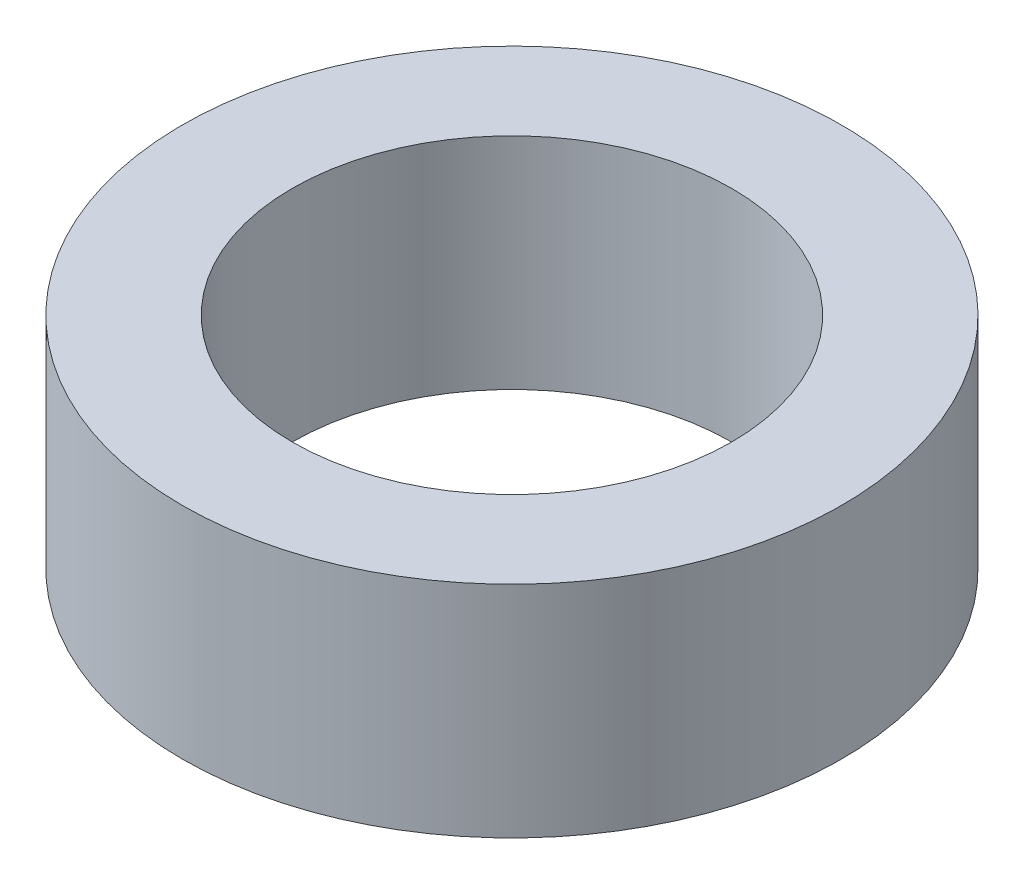
ISO-10303-21;
HEADER;
FILE_DESCRIPTION(('STEP AP214'),'2;1');
FILE_NAME('part.step','',(''),(''),'','','');
FILE_SCHEMA(('AUTOMOTIVE_DESIGN { 1 0 10303 214 1 1 1 1 }'));
ENDSEC;
DATA;
#1=APPLICATION_CONTEXT('core data for automotive mechanical design processes');
#2=APPLICATION_PROTOCOL_DEFINITION('international standard','automotive_design',2000,#1);
#3=PRODUCT_CONTEXT('',#1,'mechanical');
#4=PRODUCT('Part','Part','',(#3));
#5=PRODUCT_RELATED_PRODUCT_CATEGORY('part','',(#4));
#6=PRODUCT_DEFINITION_FORMATION('','',#4);
#7=PRODUCT_DEFINITION_CONTEXT('part definition',#1,'design');
#8=PRODUCT_DEFINITION('design','',#6,#7);
#9=PRODUCT_DEFINITION_SHAPE('','',#8);
#10=(LENGTH_UNIT() NAMED_UNIT(*) SI_UNIT(.MILLI.,.METRE.));
#11=(NAMED_UNIT(*) PLANE_ANGLE_UNIT() SI_UNIT($,.RADIAN.));
#12=(NAMED_UNIT(*) SI_UNIT($,.STERADIAN.) SOLID_ANGLE_UNIT());
#13=UNCERTAINTY_MEASURE_WITH_UNIT(LENGTH_MEASURE(1.E-05),#10,'distance_accuracy_value','');
#14=(GEOMETRIC_REPRESENTATION_CONTEXT(3) GLOBAL_UNCERTAINTY_ASSIGNED_CONTEXT((#13)) GLOBAL_UNIT_ASSIGNED_CONTEXT((#10,
#11,#12)) REPRESENTATION_CONTEXT('',''));
#15=CARTESIAN_POINT('',(0.,0.,0.));
#16=DIRECTION('',(0.,0.,1.));
#17=DIRECTION('',(1.,0.,0.));
#18=AXIS2_PLACEMENT_3D('',#15,#16,#17);
#19=CARTESIAN_POINT('',(0.,3.175,0.));
#20=DIRECTION('',(0.,1.,0.));
#21=DIRECTION('',(0.,0.,1.));
#22=AXIS2_PLACEMENT_3D('',#19,#20,#21);
#23=PLANE('',#22);
#24=CARTESIAN_POINT('',(0.,3.175,0.));
#25=DIRECTION('',(0.,1.,0.));
#26=DIRECTION('',(0.,0.,1.));
#27=AXIS2_PLACEMENT_3D('',#24,#25,#26);
#28=CIRCLE('',#27,4.7625);
#29=CARTESIAN_POINT('',(0.,3.175,4.7625));
#30=VERTEX_POINT('',#29);
#31=EDGE_CURVE('E10',#30,#30,#28,.T.);
#32=ORIENTED_EDGE('',*,*,#31,.T.);
#33=EDGE_LOOP('',(#32));
#34=FACE_BOUND('',#33,.T.);
#35=CARTESIAN_POINT('',(0.,3.175,0.));
#36=DIRECTION('',(0.,1.,0.));
#37=DIRECTION('',(0.,0.,1.));
#38=AXIS2_PLACEMENT_3D('',#35,#36,#37);
#39=CIRCLE('',#38,3.175);
#40=CARTESIAN_POINT('',(0.,3.175,3.175));
#41=VERTEX_POINT('',#40);
#42=EDGE_CURVE('E50',#41,#41,#39,.T.);
#43=ORIENTED_EDGE('',*,*,#42,.F.);
#44=EDGE_LOOP('',(#43));
#45=FACE_BOUND('',#44,.T.);
#46=ADVANCED_FACE('F37',(#34,#45),#23,.T.);
#47=CARTESIAN_POINT('',(0.,0.,0.));
#48=DIRECTION('',(0.,1.,0.));
#49=DIRECTION('',(0.,0.,1.));
#50=AXIS2_PLACEMENT_3D('',#47,#48,#49);
#51=PLANE('',#50);
#52=CARTESIAN_POINT('',(0.,0.,0.));
#53=DIRECTION('',(0.,1.,0.));
#54=DIRECTION('',(0.,0.,1.));
#55=AXIS2_PLACEMENT_3D('',#52,#53,#54);
#56=CIRCLE('',#55,4.7625);
#57=CARTESIAN_POINT('',(0.,0.,4.7625));
#58=VERTEX_POINT('',#57);
#59=EDGE_CURVE('E41',#58,#58,#56,.T.);
#60=ORIENTED_EDGE('',*,*,#59,.F.);
#61=EDGE_LOOP('',(#60));
#62=FACE_BOUND('',#61,.T.);
#63=CARTESIAN_POINT('',(0.,0.,0.));
#64=DIRECTION('',(0.,1.,0.));
#65=DIRECTION('',(0.,0.,1.));
#66=AXIS2_PLACEMENT_3D('',#63,#64,#65);
#67=CIRCLE('',#66,3.175);
#68=CARTESIAN_POINT('',(0.,0.,3.175));
#69=VERTEX_POINT('',#68);
#70=EDGE_CURVE('E52',#69,#69,#67,.T.);
#71=ORIENTED_EDGE('',*,*,#70,.T.);
#72=EDGE_LOOP('',(#71));
#73=FACE_BOUND('',#72,.T.);
#74=ADVANCED_FACE('F64',(#62,#73),#51,.F.);
#75=CARTESIAN_POINT('',(0.,3.175,0.));
#76=DIRECTION('',(0.,-1.,0.));
#77=DIRECTION('',(0.,0.,-1.));
#78=AXIS2_PLACEMENT_3D('',#75,#76,#77);
#79=CYLINDRICAL_SURFACE('',#78,4.7625);
#80=ORIENTED_EDGE('',*,*,#31,.F.);
#81=EDGE_LOOP('',(#80));
#82=FACE_BOUND('',#81,.T.);
#83=ORIENTED_EDGE('',*,*,#59,.T.);
#84=EDGE_LOOP('',(#83));
#85=FACE_BOUND('',#84,.T.);
#86=ADVANCED_FACE('F39',(#82,#85),#79,.T.);
#87=CARTESIAN_POINT('',(0.,3.175,0.));
#88=DIRECTION('',(0.,-1.,0.));
#89=DIRECTION('',(0.,0.,-1.));
#90=AXIS2_PLACEMENT_3D('',#87,#88,#89);
#91=CYLINDRICAL_SURFACE('',#90,3.175);
#92=ORIENTED_EDGE('',*,*,#42,.T.);
#93=EDGE_LOOP('',(#92));
#94=FACE_BOUND('',#93,.T.);
#95=ORIENTED_EDGE('',*,*,#70,.F.);
#96=EDGE_LOOP('',(#95));
#97=FACE_BOUND('',#96,.T.);
#98=ADVANCED_FACE('F60',(#94,#97),#91,.F.);
#99=CLOSED_SHELL('',(#46,#74,#86,#98));
#100=MANIFOLD_SOLID_BREP('B2',#99);
#101=ADVANCED_BREP_SHAPE_REPRESENTATION('',(#18,#100),#14);
#102=SHAPE_DEFINITION_REPRESENTATION(#9,#101);
ENDSEC;
END-ISO-10303-21;
